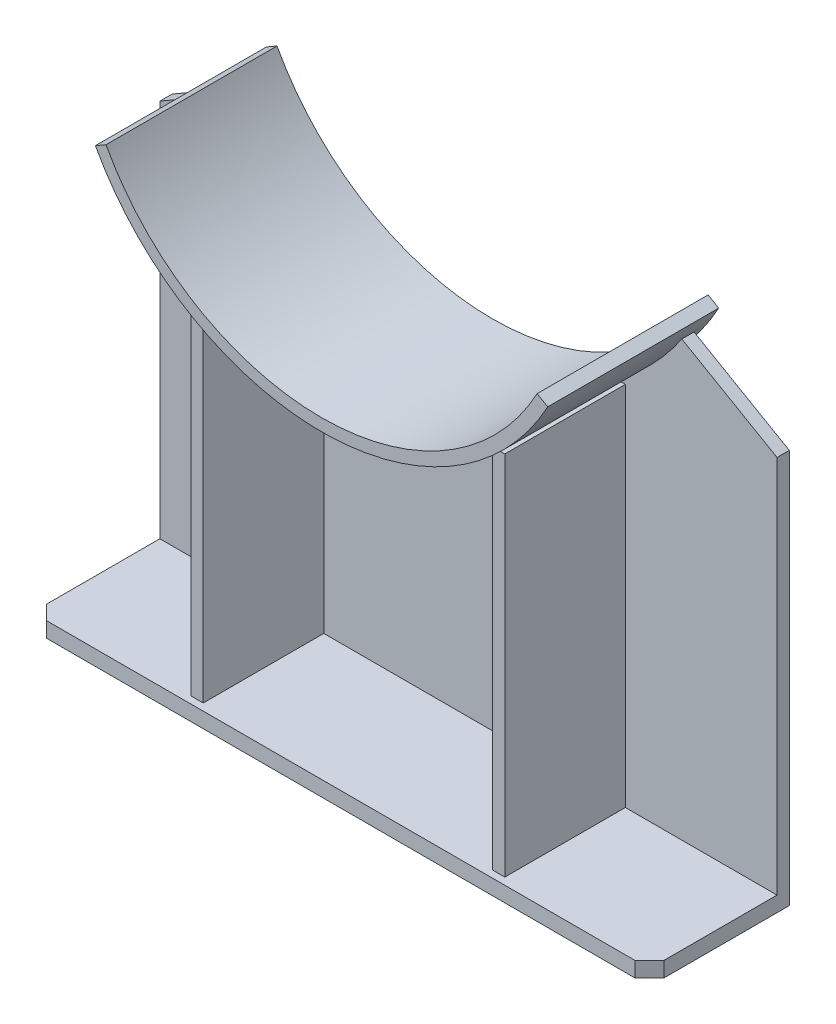
ISO-10303-21;
HEADER;
FILE_DESCRIPTION(('STEP AP214'),'2;1');
FILE_NAME('part.step','',(''),(''),'','','');
FILE_SCHEMA(('AUTOMOTIVE_DESIGN { 1 0 10303 214 1 1 1 1 }'));
ENDSEC;
DATA;
#1=APPLICATION_CONTEXT('core data for automotive mechanical design processes');
#2=APPLICATION_PROTOCOL_DEFINITION('international standard','automotive_design',2000,#1);
#3=PRODUCT_CONTEXT('',#1,'mechanical');
#4=PRODUCT('Part','Part','',(#3));
#5=PRODUCT_RELATED_PRODUCT_CATEGORY('part','',(#4));
#6=PRODUCT_DEFINITION_FORMATION('','',#4);
#7=PRODUCT_DEFINITION_CONTEXT('part definition',#1,'design');
#8=PRODUCT_DEFINITION('design','',#6,#7);
#9=PRODUCT_DEFINITION_SHAPE('','',#8);
#10=(LENGTH_UNIT() NAMED_UNIT(*) SI_UNIT(.MILLI.,.METRE.));
#11=(NAMED_UNIT(*) PLANE_ANGLE_UNIT() SI_UNIT($,.RADIAN.));
#12=(NAMED_UNIT(*) SI_UNIT($,.STERADIAN.) SOLID_ANGLE_UNIT());
#13=UNCERTAINTY_MEASURE_WITH_UNIT(LENGTH_MEASURE(1.E-05),#10,'distance_accuracy_value','');
#14=(GEOMETRIC_REPRESENTATION_CONTEXT(3) GLOBAL_UNCERTAINTY_ASSIGNED_CONTEXT((#13)) GLOBAL_UNIT_ASSIGNED_CONTEXT((#10,
#11,#12)) REPRESENTATION_CONTEXT('',''));
#15=CARTESIAN_POINT('',(0.,0.,0.));
#16=DIRECTION('',(0.,0.,1.));
#17=DIRECTION('',(1.,0.,0.));
#18=AXIS2_PLACEMENT_3D('',#15,#16,#17);
#19=CARTESIAN_POINT('',(0.,599.2,12.7));
#20=DIRECTION('',(0.,0.,1.));
#21=DIRECTION('',(1.,0.,0.));
#22=AXIS2_PLACEMENT_3D('',#19,#20,#21);
#23=PLANE('',#22);
#24=DIRECTION('',(1.,0.,0.));
#25=VECTOR('',#24,1.);
#26=CARTESIAN_POINT('',(320.,0.313790228534351,12.7));
#27=LINE('',#26,#25);
#28=CARTESIAN_POINT('',(-150.,0.313790228534293,12.7));
#29=VERTEX_POINT('',#28);
#30=CARTESIAN_POINT('',(150.,0.31379022853433,12.7));
#31=VERTEX_POINT('',#30);
#32=EDGE_CURVE('E389',#29,#31,#27,.T.);
#33=ORIENTED_EDGE('',*,*,#32,.T.);
#34=DIRECTION('',(0.,-1.,0.));
#35=VECTOR('',#34,1.);
#36=CARTESIAN_POINT('',(150.,0.313790228534349,12.7));
#37=LINE('',#36,#35);
#38=CARTESIAN_POINT('',(150.,378.680409033574,12.7));
#39=VERTEX_POINT('',#38);
#40=EDGE_CURVE('E247',#39,#31,#37,.T.);
#41=ORIENTED_EDGE('',*,*,#40,.F.);
#42=CARTESIAN_POINT('',(0.,599.2,12.7));
#43=DIRECTION('',(0.,0.,-1.));
#44=DIRECTION('',(1.,0.,0.));
#45=AXIS2_PLACEMENT_3D('',#42,#43,#44);
#46=CIRCLE('',#45,266.7);
#47=CARTESIAN_POINT('',(-150.,378.680409033574,12.7));
#48=VERTEX_POINT('',#47);
#49=EDGE_CURVE('E397',#39,#48,#46,.T.);
#50=ORIENTED_EDGE('',*,*,#49,.T.);
#51=DIRECTION('',(0.,1.,0.));
#52=VECTOR('',#51,1.);
#53=CARTESIAN_POINT('',(-150.,0.313790228534272,12.7));
#54=LINE('',#53,#52);
#55=EDGE_CURVE('E274',#29,#48,#54,.T.);
#56=ORIENTED_EDGE('',*,*,#55,.F.);
#57=EDGE_LOOP('',(#33,#41,#50,#56));
#58=FACE_BOUND('',#57,.T.);
#59=ADVANCED_FACE('F37',(#58),#23,.T.);
#60=DIRECTION('',(-1.,0.,0.));
#61=VECTOR('',#60,1.);
#62=CARTESIAN_POINT('',(150.,380.313790228534,12.7));
#63=LINE('',#62,#61);
#64=CARTESIAN_POINT('',(162.7,380.313790228534,12.7));
#65=VERTEX_POINT('',#64);
#66=CARTESIAN_POINT('',(152.373610483843,380.313790228534,12.7));
#67=VERTEX_POINT('',#66);
#68=EDGE_CURVE('E52',#65,#67,#63,.T.);
#69=ORIENTED_EDGE('',*,*,#68,.F.);
#70=DIRECTION('',(0.,1.,0.));
#71=VECTOR('',#70,1.);
#72=CARTESIAN_POINT('',(162.7,0.313790228534349,12.7));
#73=LINE('',#72,#71);
#74=CARTESIAN_POINT('',(162.7,0.313790228534331,12.7));
#75=VERTEX_POINT('',#74);
#76=EDGE_CURVE('E250',#75,#65,#73,.T.);
#77=ORIENTED_EDGE('',*,*,#76,.F.);
#78=CARTESIAN_POINT('',(320.,0.313790228534351,12.7));
#79=VERTEX_POINT('',#78);
#80=EDGE_CURVE('E224',#75,#79,#27,.T.);
#81=ORIENTED_EDGE('',*,*,#80,.T.);
#82=DIRECTION('',(0.,1.,0.));
#83=VECTOR('',#82,1.);
#84=CARTESIAN_POINT('',(320.,0.313790228534351,12.7));
#85=LINE('',#84,#83);
#86=CARTESIAN_POINT('',(320.,393.313790228534,12.7));
#87=VERTEX_POINT('',#86);
#88=EDGE_CURVE('E388',#79,#87,#85,.T.);
#89=ORIENTED_EDGE('',*,*,#88,.T.);
#90=DIRECTION('',(-0.86602540378444,0.499999999999998,0.));
#91=VECTOR('',#90,1.);
#92=CARTESIAN_POINT('',(320.,393.313790228534,12.7));
#93=LINE('',#92,#91);
#94=CARTESIAN_POINT('',(221.273103968573,450.313790228534,12.7));
#95=VERTEX_POINT('',#94);
#96=EDGE_CURVE('E391',#87,#95,#93,.T.);
#97=ORIENTED_EDGE('',*,*,#96,.T.);
#98=EDGE_CURVE('E394',#95,#67,#46,.T.);
#99=ORIENTED_EDGE('',*,*,#98,.T.);
#100=EDGE_LOOP('',(#69,#77,#81,#89,#97,#99));
#101=FACE_BOUND('',#100,.T.);
#102=ADVANCED_FACE('F441',(#101),#23,.T.);
#103=CARTESIAN_POINT('',(0.,599.2,165.));
#104=DIRECTION('',(0.,0.,-1.));
#105=DIRECTION('',(-1.,0.,0.));
#106=AXIS2_PLACEMENT_3D('',#103,#104,#105);
#107=CYLINDRICAL_SURFACE('',#106,266.7);
#108=DIRECTION('',(0.,0.,-1.));
#109=VECTOR('',#108,1.);
#110=CARTESIAN_POINT('',(-234.520553470266,472.2,165.));
#111=LINE('',#110,#109);
#112=CARTESIAN_POINT('',(-234.520553470266,472.2,165.));
#113=VERTEX_POINT('',#112);
#114=CARTESIAN_POINT('',(-234.520553470266,472.2,-12.3));
#115=VERTEX_POINT('',#114);
#116=EDGE_CURVE('E372',#113,#115,#111,.T.);
#117=ORIENTED_EDGE('',*,*,#116,.T.);
#118=CARTESIAN_POINT('',(0.,599.2,-12.3));
#119=DIRECTION('',(0.,0.,1.));
#120=DIRECTION('',(1.,0.,0.));
#121=AXIS2_PLACEMENT_3D('',#118,#119,#120);
#122=CIRCLE('',#121,266.7);
#123=CARTESIAN_POINT('',(234.520553470266,472.2,-12.3));
#124=VERTEX_POINT('',#123);
#125=EDGE_CURVE('E351',#115,#124,#122,.T.);
#126=ORIENTED_EDGE('',*,*,#125,.T.);
#127=DIRECTION('',(0.,0.,-1.));
#128=VECTOR('',#127,1.);
#129=CARTESIAN_POINT('',(234.520553470266,472.2,165.));
#130=LINE('',#129,#128);
#131=CARTESIAN_POINT('',(234.520553470266,472.2,165.));
#132=VERTEX_POINT('',#131);
#133=EDGE_CURVE('E378',#132,#124,#130,.T.);
#134=ORIENTED_EDGE('',*,*,#133,.F.);
#135=CARTESIAN_POINT('',(0.,599.2,165.));
#136=DIRECTION('',(0.,0.,1.));
#137=DIRECTION('',(1.,0.,0.));
#138=AXIS2_PLACEMENT_3D('',#135,#136,#137);
#139=CIRCLE('',#138,266.7);
#140=EDGE_CURVE('E363',#113,#132,#139,.T.);
#141=ORIENTED_EDGE('',*,*,#140,.F.);
#142=EDGE_LOOP('',(#117,#126,#134,#141));
#143=FACE_BOUND('',#142,.T.);
#144=DIRECTION('',(0.,0.,-1.));
#145=VECTOR('',#144,1.);
#146=CARTESIAN_POINT('',(150.,378.680409033574,165.));
#147=LINE('',#146,#145);
#148=CARTESIAN_POINT('',(150.,378.680409033574,137.7));
#149=VERTEX_POINT('',#148);
#150=EDGE_CURVE('E60',#149,#39,#147,.T.);
#151=ORIENTED_EDGE('',*,*,#150,.F.);
#152=CARTESIAN_POINT('',(0.,599.2,137.7));
#153=DIRECTION('',(0.,0.,-1.));
#154=DIRECTION('',(-1.,0.,0.));
#155=AXIS2_PLACEMENT_3D('',#152,#153,#154);
#156=CIRCLE('',#155,266.7);
#157=CARTESIAN_POINT('',(152.373610483843,380.313790228534,137.7));
#158=VERTEX_POINT('',#157);
#159=EDGE_CURVE('E255',#158,#149,#156,.T.);
#160=ORIENTED_EDGE('',*,*,#159,.F.);
#161=DIRECTION('',(0.,0.,-1.));
#162=VECTOR('',#161,1.);
#163=CARTESIAN_POINT('',(152.373610483843,380.313790228534,165.));
#164=LINE('',#163,#162);
#165=EDGE_CURVE('E11',#67,#158,#164,.F.);
#166=ORIENTED_EDGE('',*,*,#165,.F.);
#167=ORIENTED_EDGE('',*,*,#98,.F.);
#168=DIRECTION('',(0.,0.,-1.));
#169=VECTOR('',#168,1.);
#170=CARTESIAN_POINT('',(221.273103968573,450.313790228534,12.7));
#171=LINE('',#170,#169);
#172=CARTESIAN_POINT('',(221.273103968573,450.313790228534,0.));
#173=VERTEX_POINT('',#172);
#174=EDGE_CURVE('E417',#95,#173,#171,.T.);
#175=ORIENTED_EDGE('',*,*,#174,.T.);
#176=CARTESIAN_POINT('',(0.,599.2,0.));
#177=DIRECTION('',(0.,0.,-1.));
#178=DIRECTION('',(1.,0.,0.));
#179=AXIS2_PLACEMENT_3D('',#176,#177,#178);
#180=CIRCLE('',#179,266.7);
#181=CARTESIAN_POINT('',(-221.273103968573,450.313790228534,0.));
#182=VERTEX_POINT('',#181);
#183=EDGE_CURVE('E408',#173,#182,#180,.T.);
#184=ORIENTED_EDGE('',*,*,#183,.T.);
#185=DIRECTION('',(0.,0.,-1.));
#186=VECTOR('',#185,1.);
#187=CARTESIAN_POINT('',(-221.273103968573,450.313790228534,12.7));
#188=LINE('',#187,#186);
#189=CARTESIAN_POINT('',(-221.273103968573,450.313790228534,12.7));
#190=VERTEX_POINT('',#189);
#191=EDGE_CURVE('E414',#190,#182,#188,.T.);
#192=ORIENTED_EDGE('',*,*,#191,.F.);
#193=CARTESIAN_POINT('',(-152.373610483843,380.313790228534,12.7));
#194=VERTEX_POINT('',#193);
#195=EDGE_CURVE('E393',#194,#190,#46,.T.);
#196=ORIENTED_EDGE('',*,*,#195,.F.);
#197=DIRECTION('',(0.,0.,-1.));
#198=VECTOR('',#197,1.);
#199=CARTESIAN_POINT('',(-152.373610483843,380.313790228534,165.));
#200=LINE('',#199,#198);
#201=CARTESIAN_POINT('',(-152.373610483843,380.313790228534,137.7));
#202=VERTEX_POINT('',#201);
#203=EDGE_CURVE('E45',#202,#194,#200,.T.);
#204=ORIENTED_EDGE('',*,*,#203,.F.);
#205=CARTESIAN_POINT('',(0.,599.2,137.7));
#206=DIRECTION('',(0.,0.,-1.));
#207=DIRECTION('',(-1.,0.,0.));
#208=AXIS2_PLACEMENT_3D('',#205,#206,#207);
#209=CIRCLE('',#208,266.7);
#210=CARTESIAN_POINT('',(-150.,378.680409033574,137.7));
#211=VERTEX_POINT('',#210);
#212=EDGE_CURVE('E286',#211,#202,#209,.T.);
#213=ORIENTED_EDGE('',*,*,#212,.F.);
#214=DIRECTION('',(0.,0.,-1.));
#215=VECTOR('',#214,1.);
#216=CARTESIAN_POINT('',(-150.,378.680409033574,165.));
#217=LINE('',#216,#215);
#218=EDGE_CURVE('E289',#48,#211,#217,.F.);
#219=ORIENTED_EDGE('',*,*,#218,.F.);
#220=ORIENTED_EDGE('',*,*,#49,.F.);
#221=EDGE_LOOP('',(#151,#160,#166,#167,#175,#184,#192,#196,#204,#213,#219,#220));
#222=FACE_BOUND('',#221,.T.);
#223=ADVANCED_FACE('F428',(#143,#222),#107,.T.);
#224=CARTESIAN_POINT('',(0.,0.313790228534311,0.));
#225=DIRECTION('',(0.,-1.,0.));
#226=DIRECTION('',(1.,0.,0.));
#227=AXIS2_PLACEMENT_3D('',#224,#225,#226);
#228=PLANE('',#227);
#229=DIRECTION('',(0.,0.,-1.));
#230=VECTOR('',#229,1.);
#231=CARTESIAN_POINT('',(150.,0.313790228534349,137.7));
#232=LINE('',#231,#230);
#233=CARTESIAN_POINT('',(150.,0.31379022853433,137.7));
#234=VERTEX_POINT('',#233);
#235=EDGE_CURVE('E227',#234,#31,#232,.T.);
#236=ORIENTED_EDGE('',*,*,#235,.T.);
#237=ORIENTED_EDGE('',*,*,#32,.F.);
#238=DIRECTION('',(0.,0.,-1.));
#239=VECTOR('',#238,1.);
#240=CARTESIAN_POINT('',(-150.,0.313790228534272,137.7));
#241=LINE('',#240,#239);
#242=CARTESIAN_POINT('',(-150.,0.313790228534272,137.7));
#243=VERTEX_POINT('',#242);
#244=EDGE_CURVE('E281',#243,#29,#241,.T.);
#245=ORIENTED_EDGE('',*,*,#244,.F.);
#246=DIRECTION('',(1.,0.,0.));
#247=VECTOR('',#246,1.);
#248=CARTESIAN_POINT('',(-162.7,0.313790228534272,137.7));
#249=LINE('',#248,#247);
#250=CARTESIAN_POINT('',(-162.7,0.313790228534291,137.7));
#251=VERTEX_POINT('',#250);
#252=EDGE_CURVE('E262',#251,#243,#249,.T.);
#253=ORIENTED_EDGE('',*,*,#252,.F.);
#254=DIRECTION('',(0.,0.,-1.));
#255=VECTOR('',#254,1.);
#256=CARTESIAN_POINT('',(-162.7,0.313790228534272,137.7));
#257=LINE('',#256,#255);
#258=CARTESIAN_POINT('',(-162.7,0.313790228534292,12.7));
#259=VERTEX_POINT('',#258);
#260=EDGE_CURVE('E284',#251,#259,#257,.T.);
#261=ORIENTED_EDGE('',*,*,#260,.T.);
#262=CARTESIAN_POINT('',(-320.,0.313790228534272,12.7));
#263=VERTEX_POINT('',#262);
#264=EDGE_CURVE('E385',#263,#259,#27,.T.);
#265=ORIENTED_EDGE('',*,*,#264,.F.);
#266=DIRECTION('',(0.,0.,-1.));
#267=VECTOR('',#266,1.);
#268=CARTESIAN_POINT('',(-320.,0.313790228534272,130.));
#269=LINE('',#268,#267);
#270=CARTESIAN_POINT('',(-320.,0.313790228534272,130.));
#271=VERTEX_POINT('',#270);
#272=EDGE_CURVE('E297',#271,#263,#269,.T.);
#273=ORIENTED_EDGE('',*,*,#272,.F.);
#274=DIRECTION('',(-0.707106781186546,0.,-0.707106781186549));
#275=VECTOR('',#274,1.);
#276=CARTESIAN_POINT('',(-305.,0.313790228534274,145.));
#277=LINE('',#276,#275);
#278=CARTESIAN_POINT('',(-305.,0.313790228534274,145.));
#279=VERTEX_POINT('',#278);
#280=EDGE_CURVE('E325',#279,#271,#277,.T.);
#281=ORIENTED_EDGE('',*,*,#280,.F.);
#282=DIRECTION('',(-1.,0.,0.));
#283=VECTOR('',#282,1.);
#284=CARTESIAN_POINT('',(305.,0.313790228534349,145.));
#285=LINE('',#284,#283);
#286=CARTESIAN_POINT('',(305.,0.313790228534349,145.));
#287=VERTEX_POINT('',#286);
#288=EDGE_CURVE('E323',#287,#279,#285,.T.);
#289=ORIENTED_EDGE('',*,*,#288,.F.);
#290=DIRECTION('',(-0.707106781186547,0.,0.707106781186547));
#291=VECTOR('',#290,1.);
#292=CARTESIAN_POINT('',(320.,0.313790228534351,130.));
#293=LINE('',#292,#291);
#294=CARTESIAN_POINT('',(320.,0.313790228534351,130.));
#295=VERTEX_POINT('',#294);
#296=EDGE_CURVE('E321',#295,#287,#293,.T.);
#297=ORIENTED_EDGE('',*,*,#296,.F.);
#298=DIRECTION('',(0.,0.,1.));
#299=VECTOR('',#298,1.);
#300=CARTESIAN_POINT('',(320.,0.313790228534351,0.));
#301=LINE('',#300,#299);
#302=EDGE_CURVE('E319',#79,#295,#301,.T.);
#303=ORIENTED_EDGE('',*,*,#302,.F.);
#304=ORIENTED_EDGE('',*,*,#80,.F.);
#305=DIRECTION('',(0.,0.,-1.));
#306=VECTOR('',#305,1.);
#307=CARTESIAN_POINT('',(162.7,0.313790228534349,137.7));
#308=LINE('',#307,#306);
#309=CARTESIAN_POINT('',(162.7,0.313790228534349,137.7));
#310=VERTEX_POINT('',#309);
#311=EDGE_CURVE('E218',#310,#75,#308,.T.);
#312=ORIENTED_EDGE('',*,*,#311,.F.);
#313=DIRECTION('',(1.,0.,0.));
#314=VECTOR('',#313,1.);
#315=CARTESIAN_POINT('',(150.,0.313790228534349,137.7));
#316=LINE('',#315,#314);
#317=EDGE_CURVE('E221',#234,#310,#316,.T.);
#318=ORIENTED_EDGE('',*,*,#317,.F.);
#319=EDGE_LOOP('',(#236,#237,#245,#253,#261,#265,#273,#281,#289,#297,#303,#304,#312,#318));
#320=FACE_BOUND('',#319,.T.);
#321=ADVANCED_FACE('F220',(#320),#228,.F.);
#322=ORIENTED_EDGE('',*,*,#264,.T.);
#323=DIRECTION('',(0.,-1.,0.));
#324=VECTOR('',#323,1.);
#325=CARTESIAN_POINT('',(-162.7,0.313790228534272,12.7));
#326=LINE('',#325,#324);
#327=CARTESIAN_POINT('',(-162.7,380.313790228534,12.7));
#328=VERTEX_POINT('',#327);
#329=EDGE_CURVE('E258',#328,#259,#326,.T.);
#330=ORIENTED_EDGE('',*,*,#329,.F.);
#331=DIRECTION('',(-1.,0.,0.));
#332=VECTOR('',#331,1.);
#333=CARTESIAN_POINT('',(-162.7,380.313790228534,12.7));
#334=LINE('',#333,#332);
#335=EDGE_CURVE('E263',#194,#328,#334,.T.);
#336=ORIENTED_EDGE('',*,*,#335,.F.);
#337=ORIENTED_EDGE('',*,*,#195,.T.);
#338=DIRECTION('',(-0.86602540378444,-0.499999999999998,0.));
#339=VECTOR('',#338,1.);
#340=CARTESIAN_POINT('',(-320.,393.313790228534,12.7));
#341=LINE('',#340,#339);
#342=CARTESIAN_POINT('',(-320.,393.313790228534,12.7));
#343=VERTEX_POINT('',#342);
#344=EDGE_CURVE('E396',#190,#343,#341,.T.);
#345=ORIENTED_EDGE('',*,*,#344,.T.);
#346=DIRECTION('',(0.,-1.,0.));
#347=VECTOR('',#346,1.);
#348=CARTESIAN_POINT('',(-320.,0.313790228534272,12.7));
#349=LINE('',#348,#347);
#350=EDGE_CURVE('E381',#343,#263,#349,.T.);
#351=ORIENTED_EDGE('',*,*,#350,.T.);
#352=EDGE_LOOP('',(#322,#330,#336,#337,#345,#351));
#353=FACE_BOUND('',#352,.T.);
#354=ADVANCED_FACE('F472',(#353),#23,.T.);
#355=CARTESIAN_POINT('',(-320.,0.313790228534272,12.7));
#356=DIRECTION('',(1.,0.,0.));
#357=DIRECTION('',(0.,1.,0.));
#358=AXIS2_PLACEMENT_3D('',#355,#356,#357);
#359=PLANE('',#358);
#360=DIRECTION('',(0.,-1.,0.));
#361=VECTOR('',#360,1.);
#362=CARTESIAN_POINT('',(-320.,0.313790228534272,0.));
#363=LINE('',#362,#361);
#364=CARTESIAN_POINT('',(-320.,393.313790228534,0.));
#365=VERTEX_POINT('',#364);
#366=CARTESIAN_POINT('',(-320.,0.313790228534272,0.));
#367=VERTEX_POINT('',#366);
#368=EDGE_CURVE('E380',#365,#367,#363,.T.);
#369=ORIENTED_EDGE('',*,*,#368,.T.);
#370=DIRECTION('',(0.,1.,0.));
#371=VECTOR('',#370,1.);
#372=CARTESIAN_POINT('',(-320.,-15.4862097714657,0.));
#373=LINE('',#372,#371);
#374=CARTESIAN_POINT('',(-320.,-15.4862097714657,0.));
#375=VERTEX_POINT('',#374);
#376=EDGE_CURVE('E311',#375,#367,#373,.T.);
#377=ORIENTED_EDGE('',*,*,#376,.F.);
#378=DIRECTION('',(0.,0.,-1.));
#379=VECTOR('',#378,1.);
#380=CARTESIAN_POINT('',(-320.,-15.4862097714657,130.));
#381=LINE('',#380,#379);
#382=CARTESIAN_POINT('',(-320.,-15.4862097714657,130.));
#383=VERTEX_POINT('',#382);
#384=EDGE_CURVE('E309',#383,#375,#381,.T.);
#385=ORIENTED_EDGE('',*,*,#384,.F.);
#386=DIRECTION('',(0.,1.,0.));
#387=VECTOR('',#386,1.);
#388=CARTESIAN_POINT('',(-320.,-15.4862097714657,130.));
#389=LINE('',#388,#387);
#390=EDGE_CURVE('E330',#383,#271,#389,.T.);
#391=ORIENTED_EDGE('',*,*,#390,.T.);
#392=ORIENTED_EDGE('',*,*,#272,.T.);
#393=ORIENTED_EDGE('',*,*,#350,.F.);
#394=DIRECTION('',(0.,0.,-1.));
#395=VECTOR('',#394,1.);
#396=CARTESIAN_POINT('',(-320.,393.313790228534,12.7));
#397=LINE('',#396,#395);
#398=EDGE_CURVE('E399',#343,#365,#397,.T.);
#399=ORIENTED_EDGE('',*,*,#398,.T.);
#400=EDGE_LOOP('',(#369,#377,#385,#391,#392,#393,#399));
#401=FACE_BOUND('',#400,.T.);
#402=ADVANCED_FACE('F39',(#401),#359,.F.);
#403=CARTESIAN_POINT('',(320.,0.313790228534351,12.7));
#404=DIRECTION('',(-1.,0.,0.));
#405=DIRECTION('',(0.,-1.,0.));
#406=AXIS2_PLACEMENT_3D('',#403,#404,#405);
#407=PLANE('',#406);
#408=DIRECTION('',(0.,1.,0.));
#409=VECTOR('',#408,1.);
#410=CARTESIAN_POINT('',(320.,0.313790228534351,0.));
#411=LINE('',#410,#409);
#412=CARTESIAN_POINT('',(320.,0.313790228534351,0.));
#413=VERTEX_POINT('',#412);
#414=CARTESIAN_POINT('',(320.,393.313790228534,0.));
#415=VERTEX_POINT('',#414);
#416=EDGE_CURVE('E404',#413,#415,#411,.T.);
#417=ORIENTED_EDGE('',*,*,#416,.T.);
#418=DIRECTION('',(0.,0.,-1.));
#419=VECTOR('',#418,1.);
#420=CARTESIAN_POINT('',(320.,393.313790228534,12.7));
#421=LINE('',#420,#419);
#422=EDGE_CURVE('E420',#87,#415,#421,.T.);
#423=ORIENTED_EDGE('',*,*,#422,.F.);
#424=ORIENTED_EDGE('',*,*,#88,.F.);
#425=ORIENTED_EDGE('',*,*,#302,.T.);
#426=DIRECTION('',(0.,1.,0.));
#427=VECTOR('',#426,1.);
#428=CARTESIAN_POINT('',(320.,-15.4862097714657,130.));
#429=LINE('',#428,#427);
#430=CARTESIAN_POINT('',(320.,-15.4862097714657,130.));
#431=VERTEX_POINT('',#430);
#432=EDGE_CURVE('E339',#431,#295,#429,.T.);
#433=ORIENTED_EDGE('',*,*,#432,.F.);
#434=DIRECTION('',(0.,0.,1.));
#435=VECTOR('',#434,1.);
#436=CARTESIAN_POINT('',(320.,-15.4862097714657,0.));
#437=LINE('',#436,#435);
#438=CARTESIAN_POINT('',(320.,-15.4862097714657,0.));
#439=VERTEX_POINT('',#438);
#440=EDGE_CURVE('E301',#439,#431,#437,.T.);
#441=ORIENTED_EDGE('',*,*,#440,.F.);
#442=DIRECTION('',(0.,1.,0.));
#443=VECTOR('',#442,1.);
#444=CARTESIAN_POINT('',(320.,-15.4862097714657,0.));
#445=LINE('',#444,#443);
#446=EDGE_CURVE('E342',#439,#413,#445,.T.);
#447=ORIENTED_EDGE('',*,*,#446,.T.);
#448=EDGE_LOOP('',(#417,#423,#424,#425,#433,#441,#447));
#449=FACE_BOUND('',#448,.T.);
#450=ADVANCED_FACE('F448',(#449),#407,.F.);
#451=CARTESIAN_POINT('',(320.,393.313790228534,12.7));
#452=DIRECTION('',(-0.499999999999998,-0.86602540378444,0.));
#453=DIRECTION('',(0.86602540378444,-0.499999999999998,0.));
#454=AXIS2_PLACEMENT_3D('',#451,#452,#453);
#455=PLANE('',#454);
#456=DIRECTION('',(-0.86602540378444,0.499999999999998,0.));
#457=VECTOR('',#456,1.);
#458=CARTESIAN_POINT('',(320.,393.313790228534,0.));
#459=LINE('',#458,#457);
#460=EDGE_CURVE('E406',#415,#173,#459,.T.);
#461=ORIENTED_EDGE('',*,*,#460,.T.);
#462=ORIENTED_EDGE('',*,*,#174,.F.);
#463=ORIENTED_EDGE('',*,*,#96,.F.);
#464=ORIENTED_EDGE('',*,*,#422,.T.);
#465=EDGE_LOOP('',(#461,#462,#463,#464));
#466=FACE_BOUND('',#465,.T.);
#467=ADVANCED_FACE('F454',(#466),#455,.F.);
#468=CARTESIAN_POINT('',(-320.,393.313790228534,12.7));
#469=DIRECTION('',(0.499999999999998,-0.86602540378444,0.));
#470=DIRECTION('',(0.86602540378444,0.499999999999998,0.));
#471=AXIS2_PLACEMENT_3D('',#468,#469,#470);
#472=PLANE('',#471);
#473=DIRECTION('',(-0.86602540378444,-0.499999999999998,0.));
#474=VECTOR('',#473,1.);
#475=CARTESIAN_POINT('',(-320.,393.313790228534,0.));
#476=LINE('',#475,#474);
#477=EDGE_CURVE('E384',#182,#365,#476,.T.);
#478=ORIENTED_EDGE('',*,*,#477,.T.);
#479=ORIENTED_EDGE('',*,*,#398,.F.);
#480=ORIENTED_EDGE('',*,*,#344,.F.);
#481=ORIENTED_EDGE('',*,*,#191,.T.);
#482=EDGE_LOOP('',(#478,#479,#480,#481));
#483=FACE_BOUND('',#482,.T.);
#484=ADVANCED_FACE('F525',(#483),#472,.F.);
#485=CARTESIAN_POINT('',(0.,599.2,0.));
#486=DIRECTION('',(0.,0.,1.));
#487=DIRECTION('',(1.,0.,0.));
#488=AXIS2_PLACEMENT_3D('',#485,#486,#487);
#489=PLANE('',#488);
#490=ORIENTED_EDGE('',*,*,#368,.F.);
#491=ORIENTED_EDGE('',*,*,#477,.F.);
#492=ORIENTED_EDGE('',*,*,#183,.F.);
#493=ORIENTED_EDGE('',*,*,#460,.F.);
#494=ORIENTED_EDGE('',*,*,#416,.F.);
#495=DIRECTION('',(1.,0.,0.));
#496=VECTOR('',#495,1.);
#497=CARTESIAN_POINT('',(320.,0.313790228534351,0.));
#498=LINE('',#497,#496);
#499=EDGE_CURVE('E402',#367,#413,#498,.T.);
#500=ORIENTED_EDGE('',*,*,#499,.F.);
#501=EDGE_LOOP('',(#490,#491,#492,#493,#494,#500));
#502=FACE_BOUND('',#501,.T.);
#503=ADVANCED_FACE('F520',(#502),#489,.F.);
#504=CARTESIAN_POINT('',(234.520553470266,472.2,165.));
#505=DIRECTION('',(-0.499999999999996,-0.866025403784441,0.));
#506=DIRECTION('',(0.866025403784441,-0.499999999999996,0.));
#507=AXIS2_PLACEMENT_3D('',#504,#505,#506);
#508=PLANE('',#507);
#509=ORIENTED_EDGE('',*,*,#133,.T.);
#510=DIRECTION('',(-0.866025403784441,0.499999999999996,0.));
#511=VECTOR('',#510,1.);
#512=CARTESIAN_POINT('',(234.520553470266,472.2,-12.3));
#513=LINE('',#512,#511);
#514=CARTESIAN_POINT('',(223.517731773145,478.552482068678,-12.3));
#515=VERTEX_POINT('',#514);
#516=EDGE_CURVE('E354',#124,#515,#513,.T.);
#517=ORIENTED_EDGE('',*,*,#516,.T.);
#518=DIRECTION('',(0.,0.,-1.));
#519=VECTOR('',#518,1.);
#520=CARTESIAN_POINT('',(223.517731773145,478.552482068678,165.));
#521=LINE('',#520,#519);
#522=CARTESIAN_POINT('',(223.517731773145,478.552482068678,165.));
#523=VERTEX_POINT('',#522);
#524=EDGE_CURVE('E376',#523,#515,#521,.T.);
#525=ORIENTED_EDGE('',*,*,#524,.F.);
#526=DIRECTION('',(-0.866025403784441,0.499999999999996,0.));
#527=VECTOR('',#526,1.);
#528=CARTESIAN_POINT('',(234.520553470266,472.2,165.));
#529=LINE('',#528,#527);
#530=EDGE_CURVE('E366',#132,#523,#529,.T.);
#531=ORIENTED_EDGE('',*,*,#530,.F.);
#532=EDGE_LOOP('',(#509,#517,#525,#531));
#533=FACE_BOUND('',#532,.T.);
#534=ADVANCED_FACE('F533',(#533),#508,.F.);
#535=CARTESIAN_POINT('',(0.,599.2,165.));
#536=DIRECTION('',(0.,0.,-1.));
#537=DIRECTION('',(-1.,0.,0.));
#538=AXIS2_PLACEMENT_3D('',#535,#536,#537);
#539=CYLINDRICAL_SURFACE('',#538,254.);
#540=ORIENTED_EDGE('',*,*,#524,.T.);
#541=CARTESIAN_POINT('',(0.,599.2,-12.3));
#542=DIRECTION('',(0.,0.,-1.));
#543=DIRECTION('',(1.,0.,0.));
#544=AXIS2_PLACEMENT_3D('',#541,#542,#543);
#545=CIRCLE('',#544,254.);
#546=CARTESIAN_POINT('',(-223.517731773145,478.552482068679,-12.3));
#547=VERTEX_POINT('',#546);
#548=EDGE_CURVE('E357',#515,#547,#545,.T.);
#549=ORIENTED_EDGE('',*,*,#548,.T.);
#550=DIRECTION('',(0.,0.,-1.));
#551=VECTOR('',#550,1.);
#552=CARTESIAN_POINT('',(-223.517731773145,478.552482068679,165.));
#553=LINE('',#552,#551);
#554=CARTESIAN_POINT('',(-223.517731773145,478.552482068679,165.));
#555=VERTEX_POINT('',#554);
#556=EDGE_CURVE('E374',#555,#547,#553,.T.);
#557=ORIENTED_EDGE('',*,*,#556,.F.);
#558=CARTESIAN_POINT('',(0.,599.2,165.));
#559=DIRECTION('',(0.,0.,-1.));
#560=DIRECTION('',(1.,0.,0.));
#561=AXIS2_PLACEMENT_3D('',#558,#559,#560);
#562=CIRCLE('',#561,254.);
#563=EDGE_CURVE('E368',#523,#555,#562,.T.);
#564=ORIENTED_EDGE('',*,*,#563,.F.);
#565=EDGE_LOOP('',(#540,#549,#557,#564));
#566=FACE_BOUND('',#565,.T.);
#567=ADVANCED_FACE('F560',(#566),#539,.F.);
#568=CARTESIAN_POINT('',(-223.517731773145,478.552482068679,165.));
#569=DIRECTION('',(0.499999999999997,-0.86602540378444,0.));
#570=DIRECTION('',(0.86602540378444,0.499999999999997,0.));
#571=AXIS2_PLACEMENT_3D('',#568,#569,#570);
#572=PLANE('',#571);
#573=ORIENTED_EDGE('',*,*,#556,.T.);
#574=DIRECTION('',(-0.86602540378444,-0.499999999999997,0.));
#575=VECTOR('',#574,1.);
#576=CARTESIAN_POINT('',(-223.517731773145,478.552482068679,-12.3));
#577=LINE('',#576,#575);
#578=EDGE_CURVE('E360',#547,#115,#577,.T.);
#579=ORIENTED_EDGE('',*,*,#578,.T.);
#580=ORIENTED_EDGE('',*,*,#116,.F.);
#581=DIRECTION('',(-0.86602540378444,-0.499999999999997,0.));
#582=VECTOR('',#581,1.);
#583=CARTESIAN_POINT('',(-223.517731773145,478.552482068679,165.));
#584=LINE('',#583,#582);
#585=EDGE_CURVE('E370',#555,#113,#584,.T.);
#586=ORIENTED_EDGE('',*,*,#585,.F.);
#587=EDGE_LOOP('',(#573,#579,#580,#586));
#588=FACE_BOUND('',#587,.T.);
#589=ADVANCED_FACE('F570',(#588),#572,.F.);
#590=CARTESIAN_POINT('',(0.,599.2,165.));
#591=DIRECTION('',(0.,0.,1.));
#592=DIRECTION('',(1.,0.,0.));
#593=AXIS2_PLACEMENT_3D('',#590,#591,#592);
#594=PLANE('',#593);
#595=ORIENTED_EDGE('',*,*,#140,.T.);
#596=ORIENTED_EDGE('',*,*,#530,.T.);
#597=ORIENTED_EDGE('',*,*,#563,.T.);
#598=ORIENTED_EDGE('',*,*,#585,.T.);
#599=EDGE_LOOP('',(#595,#596,#597,#598));
#600=FACE_BOUND('',#599,.T.);
#601=ADVANCED_FACE('F580',(#600),#594,.T.);
#602=CARTESIAN_POINT('',(0.,599.2,-12.3));
#603=DIRECTION('',(0.,0.,1.));
#604=DIRECTION('',(1.,0.,0.));
#605=AXIS2_PLACEMENT_3D('',#602,#603,#604);
#606=PLANE('',#605);
#607=ORIENTED_EDGE('',*,*,#125,.F.);
#608=ORIENTED_EDGE('',*,*,#578,.F.);
#609=ORIENTED_EDGE('',*,*,#548,.F.);
#610=ORIENTED_EDGE('',*,*,#516,.F.);
#611=EDGE_LOOP('',(#607,#608,#609,#610));
#612=FACE_BOUND('',#611,.T.);
#613=ADVANCED_FACE('F590',(#612),#606,.F.);
#614=DIRECTION('',(0.707106781186546,0.,-0.707106781186549));
#615=VECTOR('',#614,1.);
#616=CARTESIAN_POINT('',(-320.,0.313790228534272,0.));
#617=LINE('',#616,#615);
#618=CARTESIAN_POINT('',(-305.,0.313790228534274,-15.));
#619=VERTEX_POINT('',#618);
#620=EDGE_CURVE('E292',#367,#619,#617,.T.);
#621=ORIENTED_EDGE('',*,*,#620,.F.);
#622=ORIENTED_EDGE('',*,*,#499,.T.);
#623=DIRECTION('',(0.707106781186548,0.,0.707106781186548));
#624=VECTOR('',#623,1.);
#625=CARTESIAN_POINT('',(305.,0.313790228534349,-15.));
#626=LINE('',#625,#624);
#627=CARTESIAN_POINT('',(305.,0.313790228534349,-15.));
#628=VERTEX_POINT('',#627);
#629=EDGE_CURVE('E316',#628,#413,#626,.T.);
#630=ORIENTED_EDGE('',*,*,#629,.F.);
#631=DIRECTION('',(1.,0.,0.));
#632=VECTOR('',#631,1.);
#633=CARTESIAN_POINT('',(-305.,0.313790228534274,-15.));
#634=LINE('',#633,#632);
#635=EDGE_CURVE('E314',#619,#628,#634,.T.);
#636=ORIENTED_EDGE('',*,*,#635,.F.);
#637=EDGE_LOOP('',(#621,#622,#630,#636));
#638=FACE_BOUND('',#637,.T.);
#639=ADVANCED_FACE('F486',(#638),#228,.F.);
#640=CARTESIAN_POINT('',(-320.,-15.4862097714657,0.));
#641=DIRECTION('',(0.707106781186549,0.,0.707106781186546));
#642=DIRECTION('',(0.707106781186546,0.,-0.707106781186549));
#643=AXIS2_PLACEMENT_3D('',#640,#641,#642);
#644=PLANE('',#643);
#645=ORIENTED_EDGE('',*,*,#620,.T.);
#646=DIRECTION('',(0.,1.,0.));
#647=VECTOR('',#646,1.);
#648=CARTESIAN_POINT('',(-305.,-15.4862097714657,-15.));
#649=LINE('',#648,#647);
#650=CARTESIAN_POINT('',(-305.,-15.4862097714657,-15.));
#651=VERTEX_POINT('',#650);
#652=EDGE_CURVE('E348',#651,#619,#649,.T.);
#653=ORIENTED_EDGE('',*,*,#652,.F.);
#654=DIRECTION('',(0.707106781186546,0.,-0.707106781186549));
#655=VECTOR('',#654,1.);
#656=CARTESIAN_POINT('',(-320.,-15.4862097714657,0.));
#657=LINE('',#656,#655);
#658=EDGE_CURVE('E293',#375,#651,#657,.T.);
#659=ORIENTED_EDGE('',*,*,#658,.F.);
#660=ORIENTED_EDGE('',*,*,#376,.T.);
#661=EDGE_LOOP('',(#645,#653,#659,#660));
#662=FACE_BOUND('',#661,.T.);
#663=ADVANCED_FACE('F621',(#662),#644,.F.);
#664=CARTESIAN_POINT('',(-305.,-15.4862097714657,-15.));
#665=DIRECTION('',(0.,0.,1.));
#666=DIRECTION('',(1.,0.,0.));
#667=AXIS2_PLACEMENT_3D('',#664,#665,#666);
#668=PLANE('',#667);
#669=ORIENTED_EDGE('',*,*,#635,.T.);
#670=DIRECTION('',(0.,1.,0.));
#671=VECTOR('',#670,1.);
#672=CARTESIAN_POINT('',(305.,-15.4862097714657,-15.));
#673=LINE('',#672,#671);
#674=CARTESIAN_POINT('',(305.,-15.4862097714657,-15.));
#675=VERTEX_POINT('',#674);
#676=EDGE_CURVE('E345',#675,#628,#673,.T.);
#677=ORIENTED_EDGE('',*,*,#676,.F.);
#678=DIRECTION('',(1.,0.,0.));
#679=VECTOR('',#678,1.);
#680=CARTESIAN_POINT('',(-305.,-15.4862097714657,-15.));
#681=LINE('',#680,#679);
#682=EDGE_CURVE('E296',#651,#675,#681,.T.);
#683=ORIENTED_EDGE('',*,*,#682,.F.);
#684=ORIENTED_EDGE('',*,*,#652,.T.);
#685=EDGE_LOOP('',(#669,#677,#683,#684));
#686=FACE_BOUND('',#685,.T.);
#687=ADVANCED_FACE('F628',(#686),#668,.F.);
#688=CARTESIAN_POINT('',(305.,-15.4862097714657,-15.));
#689=DIRECTION('',(-0.707106781186548,0.,0.707106781186548));
#690=DIRECTION('',(0.707106781186548,0.,0.707106781186548));
#691=AXIS2_PLACEMENT_3D('',#688,#689,#690);
#692=PLANE('',#691);
#693=ORIENTED_EDGE('',*,*,#629,.T.);
#694=ORIENTED_EDGE('',*,*,#446,.F.);
#695=DIRECTION('',(0.707106781186548,0.,0.707106781186548));
#696=VECTOR('',#695,1.);
#697=CARTESIAN_POINT('',(305.,-15.4862097714657,-15.));
#698=LINE('',#697,#696);
#699=EDGE_CURVE('E299',#675,#439,#698,.T.);
#700=ORIENTED_EDGE('',*,*,#699,.F.);
#701=ORIENTED_EDGE('',*,*,#676,.T.);
#702=EDGE_LOOP('',(#693,#694,#700,#701));
#703=FACE_BOUND('',#702,.T.);
#704=ADVANCED_FACE('F513',(#703),#692,.F.);
#705=CARTESIAN_POINT('',(320.,-15.4862097714657,130.));
#706=DIRECTION('',(-0.707106781186548,0.,-0.707106781186548));
#707=DIRECTION('',(-0.707106781186548,0.,0.707106781186548));
#708=AXIS2_PLACEMENT_3D('',#705,#706,#707);
#709=PLANE('',#708);
#710=ORIENTED_EDGE('',*,*,#296,.T.);
#711=DIRECTION('',(0.,1.,0.));
#712=VECTOR('',#711,1.);
#713=CARTESIAN_POINT('',(305.,-15.4862097714657,145.));
#714=LINE('',#713,#712);
#715=CARTESIAN_POINT('',(305.,-15.4862097714657,145.));
#716=VERTEX_POINT('',#715);
#717=EDGE_CURVE('E336',#716,#287,#714,.T.);
#718=ORIENTED_EDGE('',*,*,#717,.F.);
#719=DIRECTION('',(-0.707106781186547,0.,0.707106781186547));
#720=VECTOR('',#719,1.);
#721=CARTESIAN_POINT('',(320.,-15.4862097714657,130.));
#722=LINE('',#721,#720);
#723=EDGE_CURVE('E303',#431,#716,#722,.T.);
#724=ORIENTED_EDGE('',*,*,#723,.F.);
#725=ORIENTED_EDGE('',*,*,#432,.T.);
#726=EDGE_LOOP('',(#710,#718,#724,#725));
#727=FACE_BOUND('',#726,.T.);
#728=ADVANCED_FACE('F505',(#727),#709,.F.);
#729=CARTESIAN_POINT('',(305.,-15.4862097714657,145.));
#730=DIRECTION('',(0.,0.,-1.));
#731=DIRECTION('',(-1.,0.,0.));
#732=AXIS2_PLACEMENT_3D('',#729,#730,#731);
#733=PLANE('',#732);
#734=ORIENTED_EDGE('',*,*,#288,.T.);
#735=DIRECTION('',(0.,1.,0.));
#736=VECTOR('',#735,1.);
#737=CARTESIAN_POINT('',(-305.,-15.4862097714657,145.));
#738=LINE('',#737,#736);
#739=CARTESIAN_POINT('',(-305.,-15.4862097714657,145.));
#740=VERTEX_POINT('',#739);
#741=EDGE_CURVE('E333',#740,#279,#738,.T.);
#742=ORIENTED_EDGE('',*,*,#741,.F.);
#743=DIRECTION('',(-1.,0.,0.));
#744=VECTOR('',#743,1.);
#745=CARTESIAN_POINT('',(305.,-15.4862097714657,145.));
#746=LINE('',#745,#744);
#747=EDGE_CURVE('E305',#716,#740,#746,.T.);
#748=ORIENTED_EDGE('',*,*,#747,.F.);
#749=ORIENTED_EDGE('',*,*,#717,.T.);
#750=EDGE_LOOP('',(#734,#742,#748,#749));
#751=FACE_BOUND('',#750,.T.);
#752=ADVANCED_FACE('F500',(#751),#733,.F.);
#753=CARTESIAN_POINT('',(-305.,-15.4862097714657,145.));
#754=DIRECTION('',(0.707106781186549,0.,-0.707106781186546));
#755=DIRECTION('',(-0.707106781186546,0.,-0.707106781186549));
#756=AXIS2_PLACEMENT_3D('',#753,#754,#755);
#757=PLANE('',#756);
#758=ORIENTED_EDGE('',*,*,#280,.T.);
#759=ORIENTED_EDGE('',*,*,#390,.F.);
#760=DIRECTION('',(-0.707106781186546,0.,-0.707106781186549));
#761=VECTOR('',#760,1.);
#762=CARTESIAN_POINT('',(-305.,-15.4862097714657,145.));
#763=LINE('',#762,#761);
#764=EDGE_CURVE('E307',#740,#383,#763,.T.);
#765=ORIENTED_EDGE('',*,*,#764,.F.);
#766=ORIENTED_EDGE('',*,*,#741,.T.);
#767=EDGE_LOOP('',(#758,#759,#765,#766));
#768=FACE_BOUND('',#767,.T.);
#769=ADVANCED_FACE('F497',(#768),#757,.F.);
#770=CARTESIAN_POINT('',(0.,-15.4862097714657,0.));
#771=DIRECTION('',(0.,-1.,0.));
#772=DIRECTION('',(1.,0.,0.));
#773=AXIS2_PLACEMENT_3D('',#770,#771,#772);
#774=PLANE('',#773);
#775=ORIENTED_EDGE('',*,*,#658,.T.);
#776=ORIENTED_EDGE('',*,*,#682,.T.);
#777=ORIENTED_EDGE('',*,*,#699,.T.);
#778=ORIENTED_EDGE('',*,*,#440,.T.);
#779=ORIENTED_EDGE('',*,*,#723,.T.);
#780=ORIENTED_EDGE('',*,*,#747,.T.);
#781=ORIENTED_EDGE('',*,*,#764,.T.);
#782=ORIENTED_EDGE('',*,*,#384,.T.);
#783=EDGE_LOOP('',(#775,#776,#777,#778,#779,#780,#781,#782));
#784=FACE_BOUND('',#783,.T.);
#785=ADVANCED_FACE('F509',(#784),#774,.T.);
#786=CARTESIAN_POINT('',(-162.7,380.313790228534,137.7));
#787=DIRECTION('',(0.,-1.,0.));
#788=DIRECTION('',(0.,0.,-1.));
#789=AXIS2_PLACEMENT_3D('',#786,#787,#788);
#790=PLANE('',#789);
#791=DIRECTION('',(-1.,0.,0.));
#792=VECTOR('',#791,1.);
#793=CARTESIAN_POINT('',(-162.7,380.313790228534,137.7));
#794=LINE('',#793,#792);
#795=CARTESIAN_POINT('',(-162.7,380.313790228534,137.7));
#796=VERTEX_POINT('',#795);
#797=EDGE_CURVE('E269',#202,#796,#794,.T.);
#798=ORIENTED_EDGE('',*,*,#797,.F.);
#799=ORIENTED_EDGE('',*,*,#203,.T.);
#800=ORIENTED_EDGE('',*,*,#335,.T.);
#801=DIRECTION('',(0.,0.,-1.));
#802=VECTOR('',#801,1.);
#803=CARTESIAN_POINT('',(-162.7,380.313790228534,137.7));
#804=LINE('',#803,#802);
#805=EDGE_CURVE('E271',#796,#328,#804,.T.);
#806=ORIENTED_EDGE('',*,*,#805,.F.);
#807=EDGE_LOOP('',(#798,#799,#800,#806));
#808=FACE_BOUND('',#807,.T.);
#809=ADVANCED_FACE('F425',(#808),#790,.F.);
#810=CARTESIAN_POINT('',(-150.,0.313790228534272,137.7));
#811=DIRECTION('',(-1.,0.,0.));
#812=DIRECTION('',(0.,0.,1.));
#813=AXIS2_PLACEMENT_3D('',#810,#811,#812);
#814=PLANE('',#813);
#815=ORIENTED_EDGE('',*,*,#55,.T.);
#816=ORIENTED_EDGE('',*,*,#218,.T.);
#817=DIRECTION('',(0.,1.,0.));
#818=VECTOR('',#817,1.);
#819=CARTESIAN_POINT('',(-150.,0.313790228534272,137.7));
#820=LINE('',#819,#818);
#821=EDGE_CURVE('E266',#243,#211,#820,.T.);
#822=ORIENTED_EDGE('',*,*,#821,.F.);
#823=ORIENTED_EDGE('',*,*,#244,.T.);
#824=EDGE_LOOP('',(#815,#816,#822,#823));
#825=FACE_BOUND('',#824,.T.);
#826=ADVANCED_FACE('F435',(#825),#814,.F.);
#827=CARTESIAN_POINT('',(0.,0.,137.7));
#828=DIRECTION('',(0.,0.,-1.));
#829=DIRECTION('',(-1.,0.,0.));
#830=AXIS2_PLACEMENT_3D('',#827,#828,#829);
#831=PLANE('',#830);
#832=ORIENTED_EDGE('',*,*,#821,.T.);
#833=ORIENTED_EDGE('',*,*,#212,.T.);
#834=ORIENTED_EDGE('',*,*,#797,.T.);
#835=DIRECTION('',(0.,-1.,0.));
#836=VECTOR('',#835,1.);
#837=CARTESIAN_POINT('',(-162.7,0.313790228534272,137.7));
#838=LINE('',#837,#836);
#839=EDGE_CURVE('E259',#796,#251,#838,.T.);
#840=ORIENTED_EDGE('',*,*,#839,.T.);
#841=ORIENTED_EDGE('',*,*,#252,.T.);
#842=EDGE_LOOP('',(#832,#833,#834,#840,#841));
#843=FACE_BOUND('',#842,.T.);
#844=ADVANCED_FACE('F432',(#843),#831,.F.);
#845=CARTESIAN_POINT('',(-162.7,0.313790228534272,137.7));
#846=DIRECTION('',(1.,0.,0.));
#847=DIRECTION('',(0.,0.,-1.));
#848=AXIS2_PLACEMENT_3D('',#845,#846,#847);
#849=PLANE('',#848);
#850=ORIENTED_EDGE('',*,*,#329,.T.);
#851=ORIENTED_EDGE('',*,*,#260,.F.);
#852=ORIENTED_EDGE('',*,*,#839,.F.);
#853=ORIENTED_EDGE('',*,*,#805,.T.);
#854=EDGE_LOOP('',(#850,#851,#852,#853));
#855=FACE_BOUND('',#854,.T.);
#856=ADVANCED_FACE('F459',(#855),#849,.F.);
#857=CARTESIAN_POINT('',(150.,380.313790228534,137.7));
#858=DIRECTION('',(0.,-1.,0.));
#859=DIRECTION('',(0.,0.,-1.));
#860=AXIS2_PLACEMENT_3D('',#857,#858,#859);
#861=PLANE('',#860);
#862=ORIENTED_EDGE('',*,*,#68,.T.);
#863=ORIENTED_EDGE('',*,*,#165,.T.);
#864=DIRECTION('',(-1.,0.,0.));
#865=VECTOR('',#864,1.);
#866=CARTESIAN_POINT('',(150.,380.313790228534,137.7));
#867=LINE('',#866,#865);
#868=CARTESIAN_POINT('',(162.7,380.313790228534,137.7));
#869=VERTEX_POINT('',#868);
#870=EDGE_CURVE('E242',#869,#158,#867,.T.);
#871=ORIENTED_EDGE('',*,*,#870,.F.);
#872=DIRECTION('',(0.,0.,-1.));
#873=VECTOR('',#872,1.);
#874=CARTESIAN_POINT('',(162.7,380.313790228534,137.7));
#875=LINE('',#874,#873);
#876=EDGE_CURVE('E228',#869,#65,#875,.T.);
#877=ORIENTED_EDGE('',*,*,#876,.T.);
#878=EDGE_LOOP('',(#862,#863,#871,#877));
#879=FACE_BOUND('',#878,.T.);
#880=ADVANCED_FACE('F457',(#879),#861,.F.);
#881=CARTESIAN_POINT('',(150.,0.313790228534349,137.7));
#882=DIRECTION('',(1.,0.,0.));
#883=DIRECTION('',(0.,0.,-1.));
#884=AXIS2_PLACEMENT_3D('',#881,#882,#883);
#885=PLANE('',#884);
#886=DIRECTION('',(0.,-1.,0.));
#887=VECTOR('',#886,1.);
#888=CARTESIAN_POINT('',(150.,0.313790228534349,137.7));
#889=LINE('',#888,#887);
#890=EDGE_CURVE('E236',#149,#234,#889,.T.);
#891=ORIENTED_EDGE('',*,*,#890,.F.);
#892=ORIENTED_EDGE('',*,*,#150,.T.);
#893=ORIENTED_EDGE('',*,*,#40,.T.);
#894=ORIENTED_EDGE('',*,*,#235,.F.);
#895=EDGE_LOOP('',(#891,#892,#893,#894));
#896=FACE_BOUND('',#895,.T.);
#897=ADVANCED_FACE('F438',(#896),#885,.F.);
#898=CARTESIAN_POINT('',(0.,0.,137.7));
#899=DIRECTION('',(0.,0.,-1.));
#900=DIRECTION('',(-1.,0.,0.));
#901=AXIS2_PLACEMENT_3D('',#898,#899,#900);
#902=PLANE('',#901);
#903=ORIENTED_EDGE('',*,*,#870,.T.);
#904=ORIENTED_EDGE('',*,*,#159,.T.);
#905=ORIENTED_EDGE('',*,*,#890,.T.);
#906=ORIENTED_EDGE('',*,*,#317,.T.);
#907=DIRECTION('',(0.,1.,0.));
#908=VECTOR('',#907,1.);
#909=CARTESIAN_POINT('',(162.7,0.313790228534349,137.7));
#910=LINE('',#909,#908);
#911=EDGE_CURVE('E233',#310,#869,#910,.T.);
#912=ORIENTED_EDGE('',*,*,#911,.T.);
#913=EDGE_LOOP('',(#903,#904,#905,#906,#912));
#914=FACE_BOUND('',#913,.T.);
#915=ADVANCED_FACE('F232',(#914),#902,.F.);
#916=CARTESIAN_POINT('',(162.7,0.313790228534349,137.7));
#917=DIRECTION('',(-1.,0.,0.));
#918=DIRECTION('',(0.,0.,1.));
#919=AXIS2_PLACEMENT_3D('',#916,#917,#918);
#920=PLANE('',#919);
#921=ORIENTED_EDGE('',*,*,#76,.T.);
#922=ORIENTED_EDGE('',*,*,#876,.F.);
#923=ORIENTED_EDGE('',*,*,#911,.F.);
#924=ORIENTED_EDGE('',*,*,#311,.T.);
#925=EDGE_LOOP('',(#921,#922,#923,#924));
#926=FACE_BOUND('',#925,.T.);
#927=ADVANCED_FACE('F239',(#926),#920,.F.);
#928=CLOSED_SHELL('',(#59,#102,#223,#321,#354,#402,#450,#467,#484,#503,#534,#567,#589,#601,#613,
#639,#663,#687,#704,#728,#752,#769,#785,#809,#826,#844,#856,#880,#897,#915,#927));
#929=MANIFOLD_SOLID_BREP('B2',#928);
#930=ADVANCED_BREP_SHAPE_REPRESENTATION('',(#18,#929),#14);
#931=SHAPE_DEFINITION_REPRESENTATION(#9,#930);
ENDSEC;
END-ISO-10303-21;
